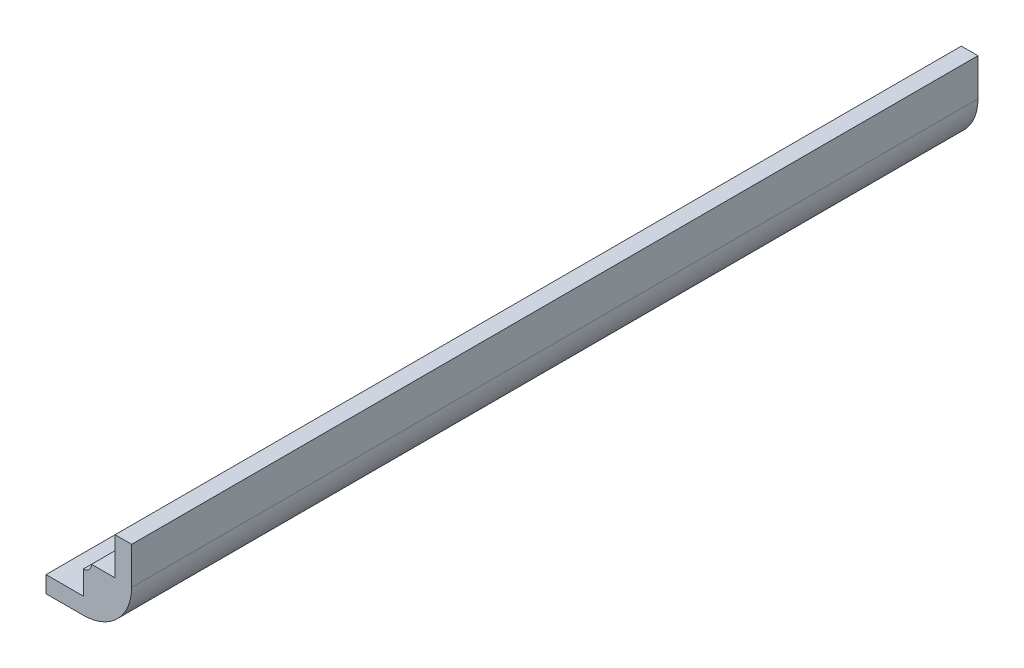
ISO-10303-21;
HEADER;
FILE_DESCRIPTION(('STEP AP214'),'2;1');
FILE_NAME('part.step','',(''),(''),'','','');
FILE_SCHEMA(('AUTOMOTIVE_DESIGN { 1 0 10303 214 1 1 1 1 }'));
ENDSEC;
DATA;
#1=APPLICATION_CONTEXT('core data for automotive mechanical design processes');
#2=APPLICATION_PROTOCOL_DEFINITION('international standard','automotive_design',2000,#1);
#3=PRODUCT_CONTEXT('',#1,'mechanical');
#4=PRODUCT('Part','Part','',(#3));
#5=PRODUCT_RELATED_PRODUCT_CATEGORY('part','',(#4));
#6=PRODUCT_DEFINITION_FORMATION('','',#4);
#7=PRODUCT_DEFINITION_CONTEXT('part definition',#1,'design');
#8=PRODUCT_DEFINITION('design','',#6,#7);
#9=PRODUCT_DEFINITION_SHAPE('','',#8);
#10=(LENGTH_UNIT() NAMED_UNIT(*) SI_UNIT(.MILLI.,.METRE.));
#11=(NAMED_UNIT(*) PLANE_ANGLE_UNIT() SI_UNIT($,.RADIAN.));
#12=(NAMED_UNIT(*) SI_UNIT($,.STERADIAN.) SOLID_ANGLE_UNIT());
#13=UNCERTAINTY_MEASURE_WITH_UNIT(LENGTH_MEASURE(1.E-05),#10,'distance_accuracy_value','');
#14=(GEOMETRIC_REPRESENTATION_CONTEXT(3) GLOBAL_UNCERTAINTY_ASSIGNED_CONTEXT((#13)) GLOBAL_UNIT_ASSIGNED_CONTEXT((#10,
#11,#12)) REPRESENTATION_CONTEXT('',''));
#15=CARTESIAN_POINT('',(0.,0.,0.));
#16=DIRECTION('',(0.,0.,1.));
#17=DIRECTION('',(1.,0.,0.));
#18=AXIS2_PLACEMENT_3D('',#15,#16,#17);
#19=CARTESIAN_POINT('',(-7.3025,-1.500000048,53.975));
#20=DIRECTION('',(1.,0.,0.));
#21=DIRECTION('',(0.,0.,-1.));
#22=AXIS2_PLACEMENT_3D('',#19,#20,#21);
#23=PLANE('',#22);
#24=DIRECTION('',(0.,-1.,0.));
#25=VECTOR('',#24,1.);
#26=CARTESIAN_POINT('',(-7.3025,-1.500000048,-53.975));
#27=LINE('',#26,#25);
#28=CARTESIAN_POINT('',(-7.3025,-1.500000048,-53.975));
#29=VERTEX_POINT('',#28);
#30=CARTESIAN_POINT('',(-7.3025,-3.621225168,-53.975));
#31=VERTEX_POINT('',#30);
#32=EDGE_CURVE('E91',#29,#31,#27,.T.);
#33=ORIENTED_EDGE('',*,*,#32,.T.);
#34=DIRECTION('',(0.,0.,-1.));
#35=VECTOR('',#34,1.);
#36=CARTESIAN_POINT('',(-7.3025,-3.621225168,53.975));
#37=LINE('',#36,#35);
#38=CARTESIAN_POINT('',(-7.3025,-3.621225168,53.975));
#39=VERTEX_POINT('',#38);
#40=EDGE_CURVE('E11',#39,#31,#37,.T.);
#41=ORIENTED_EDGE('',*,*,#40,.F.);
#42=DIRECTION('',(0.,-1.,0.));
#43=VECTOR('',#42,1.);
#44=CARTESIAN_POINT('',(-7.3025,-1.500000048,53.975));
#45=LINE('',#44,#43);
#46=CARTESIAN_POINT('',(-7.3025,-1.500000048,53.975));
#47=VERTEX_POINT('',#46);
#48=EDGE_CURVE('E85',#47,#39,#45,.T.);
#49=ORIENTED_EDGE('',*,*,#48,.F.);
#50=DIRECTION('',(0.,0.,-1.));
#51=VECTOR('',#50,1.);
#52=CARTESIAN_POINT('',(-7.3025,-1.500000048,53.975));
#53=LINE('',#52,#51);
#54=EDGE_CURVE('E79',#47,#29,#53,.T.);
#55=ORIENTED_EDGE('',*,*,#54,.T.);
#56=EDGE_LOOP('',(#33,#41,#49,#55));
#57=FACE_BOUND('',#56,.T.);
#58=ADVANCED_FACE('F39',(#57),#23,.F.);
#59=CARTESIAN_POINT('',(-7.3025,-3.621225168,53.975));
#60=DIRECTION('',(0.,1.,0.));
#61=DIRECTION('',(0.,0.,1.));
#62=AXIS2_PLACEMENT_3D('',#59,#60,#61);
#63=PLANE('',#62);
#64=DIRECTION('',(1.,0.,0.));
#65=VECTOR('',#64,1.);
#66=CARTESIAN_POINT('',(-7.3025,-3.621225168,-53.975));
#67=LINE('',#66,#65);
#68=CARTESIAN_POINT('',(-2.54,-3.62122516799999,-53.975));
#69=VERTEX_POINT('',#68);
#70=EDGE_CURVE('E86',#31,#69,#67,.T.);
#71=ORIENTED_EDGE('',*,*,#70,.T.);
#72=DIRECTION('',(0.,0.,-1.));
#73=VECTOR('',#72,1.);
#74=CARTESIAN_POINT('',(-2.54,-3.621225168,53.975));
#75=LINE('',#74,#73);
#76=CARTESIAN_POINT('',(-2.54,-3.62122516799999,53.975));
#77=VERTEX_POINT('',#76);
#78=EDGE_CURVE('E48',#77,#69,#75,.T.);
#79=ORIENTED_EDGE('',*,*,#78,.F.);
#80=DIRECTION('',(1.,0.,0.));
#81=VECTOR('',#80,1.);
#82=CARTESIAN_POINT('',(-7.3025,-3.621225168,53.975));
#83=LINE('',#82,#81);
#84=EDGE_CURVE('E135',#39,#77,#83,.T.);
#85=ORIENTED_EDGE('',*,*,#84,.F.);
#86=ORIENTED_EDGE('',*,*,#40,.T.);
#87=EDGE_LOOP('',(#71,#79,#85,#86));
#88=FACE_BOUND('',#87,.T.);
#89=ADVANCED_FACE('F134',(#88),#63,.F.);
#90=CARTESIAN_POINT('',(-7.3025,-1.500000048,53.975));
#91=DIRECTION('',(0.,-1.,0.));
#92=DIRECTION('',(1.,0.,0.));
#93=AXIS2_PLACEMENT_3D('',#90,#91,#92);
#94=PLANE('',#93);
#95=DIRECTION('',(-1.,0.,0.));
#96=VECTOR('',#95,1.);
#97=CARTESIAN_POINT('',(-7.3025,-1.500000048,-53.975));
#98=LINE('',#97,#96);
#99=CARTESIAN_POINT('',(-2.54,-1.500000048,-53.975));
#100=VERTEX_POINT('',#99);
#101=EDGE_CURVE('E76',#100,#29,#98,.T.);
#102=ORIENTED_EDGE('',*,*,#101,.T.);
#103=ORIENTED_EDGE('',*,*,#54,.F.);
#104=DIRECTION('',(-1.,0.,0.));
#105=VECTOR('',#104,1.);
#106=CARTESIAN_POINT('',(-7.3025,-1.500000048,53.975));
#107=LINE('',#106,#105);
#108=CARTESIAN_POINT('',(-2.54,-1.500000048,53.975));
#109=VERTEX_POINT('',#108);
#110=EDGE_CURVE('E56',#109,#47,#107,.T.);
#111=ORIENTED_EDGE('',*,*,#110,.F.);
#112=DIRECTION('',(0.,0.,-1.));
#113=VECTOR('',#112,1.);
#114=CARTESIAN_POINT('',(-2.54,-1.500000048,53.975));
#115=LINE('',#114,#113);
#116=EDGE_CURVE('E81',#109,#100,#115,.T.);
#117=ORIENTED_EDGE('',*,*,#116,.T.);
#118=EDGE_LOOP('',(#102,#103,#111,#117));
#119=FACE_BOUND('',#118,.T.);
#120=ADVANCED_FACE('F78',(#119),#94,.F.);
#121=CARTESIAN_POINT('',(0.,0.,53.975));
#122=DIRECTION('',(0.,0.,1.));
#123=DIRECTION('',(1.,0.,0.));
#124=AXIS2_PLACEMENT_3D('',#121,#122,#123);
#125=PLANE('',#124);
#126=DIRECTION('',(0.,-1.,0.));
#127=VECTOR('',#126,1.);
#128=CARTESIAN_POINT('',(1.50000004799997,7.30250000000001,53.975));
#129=LINE('',#128,#127);
#130=CARTESIAN_POINT('',(1.50000004799997,7.30250000000001,53.975));
#131=VERTEX_POINT('',#130);
#132=CARTESIAN_POINT('',(1.50000004799999,2.54000000000001,53.975));
#133=VERTEX_POINT('',#132);
#134=EDGE_CURVE('E185',#131,#133,#129,.T.);
#135=ORIENTED_EDGE('',*,*,#134,.T.);
#136=DIRECTION('',(-1.,0.,0.));
#137=VECTOR('',#136,1.);
#138=CARTESIAN_POINT('',(1.50000004799999,2.54000000000001,53.975));
#139=LINE('',#138,#137);
#140=CARTESIAN_POINT('',(-1.50000004800001,2.53999999999999,53.975));
#141=VERTEX_POINT('',#140);
#142=EDGE_CURVE('E160',#133,#141,#139,.T.);
#143=ORIENTED_EDGE('',*,*,#142,.T.);
#144=CARTESIAN_POINT('',(-2.54,2.53999999999999,53.975));
#145=DIRECTION('',(0.,0.,-1.));
#146=DIRECTION('',(-1.,0.,0.));
#147=AXIS2_PLACEMENT_3D('',#144,#145,#146);
#148=CIRCLE('',#147,1.03999995199999);
#149=CARTESIAN_POINT('',(-2.54,1.500000048,53.975));
#150=VERTEX_POINT('',#149);
#151=EDGE_CURVE('E165',#141,#150,#148,.T.);
#152=ORIENTED_EDGE('',*,*,#151,.T.);
#153=DIRECTION('',(0.,-1.,0.));
#154=VECTOR('',#153,1.);
#155=CARTESIAN_POINT('',(-2.54,1.500000048,53.975));
#156=LINE('',#155,#154);
#157=EDGE_CURVE('E198',#150,#109,#156,.T.);
#158=ORIENTED_EDGE('',*,*,#157,.T.);
#159=ORIENTED_EDGE('',*,*,#110,.T.);
#160=ORIENTED_EDGE('',*,*,#48,.T.);
#161=ORIENTED_EDGE('',*,*,#84,.T.);
#162=CARTESIAN_POINT('',(-2.54,2.53999999999999,53.975));
#163=DIRECTION('',(0.,0.,1.));
#164=DIRECTION('',(-1.,0.,0.));
#165=AXIS2_PLACEMENT_3D('',#162,#163,#164);
#166=CIRCLE('',#165,6.16122516799998);
#167=CARTESIAN_POINT('',(3.62122516799997,2.54000000000002,53.975));
#168=VERTEX_POINT('',#167);
#169=EDGE_CURVE('E124',#77,#168,#166,.T.);
#170=ORIENTED_EDGE('',*,*,#169,.T.);
#171=DIRECTION('',(0.,1.,0.));
#172=VECTOR('',#171,1.);
#173=CARTESIAN_POINT('',(3.62122516799997,7.30250000000001,53.975));
#174=LINE('',#173,#172);
#175=CARTESIAN_POINT('',(3.62122516799997,7.30250000000001,53.975));
#176=VERTEX_POINT('',#175);
#177=EDGE_CURVE('E192',#168,#176,#174,.T.);
#178=ORIENTED_EDGE('',*,*,#177,.T.);
#179=DIRECTION('',(-1.,0.,0.));
#180=VECTOR('',#179,1.);
#181=CARTESIAN_POINT('',(3.62122516799997,7.30250000000001,53.975));
#182=LINE('',#181,#180);
#183=EDGE_CURVE('E188',#176,#131,#182,.T.);
#184=ORIENTED_EDGE('',*,*,#183,.T.);
#185=EDGE_LOOP('',(#135,#143,#152,#158,#159,#160,#161,#170,#178,#184));
#186=FACE_BOUND('',#185,.T.);
#187=ADVANCED_FACE('F138',(#186),#125,.T.);
#188=CARTESIAN_POINT('',(0.,0.,-53.975));
#189=DIRECTION('',(0.,0.,1.));
#190=DIRECTION('',(1.,0.,0.));
#191=AXIS2_PLACEMENT_3D('',#188,#189,#190);
#192=PLANE('',#191);
#193=DIRECTION('',(0.,1.,0.));
#194=VECTOR('',#193,1.);
#195=CARTESIAN_POINT('',(3.62122516799997,7.30250000000001,-53.975));
#196=LINE('',#195,#194);
#197=CARTESIAN_POINT('',(3.62122516799997,2.54000000000002,-53.975));
#198=VERTEX_POINT('',#197);
#199=CARTESIAN_POINT('',(3.62122516799997,7.30250000000001,-53.975));
#200=VERTEX_POINT('',#199);
#201=EDGE_CURVE('E131',#198,#200,#196,.T.);
#202=ORIENTED_EDGE('',*,*,#201,.F.);
#203=CARTESIAN_POINT('',(-2.54,2.53999999999999,-53.975));
#204=DIRECTION('',(0.,0.,1.));
#205=DIRECTION('',(-1.,0.,0.));
#206=AXIS2_PLACEMENT_3D('',#203,#204,#205);
#207=CIRCLE('',#206,6.16122516799998);
#208=EDGE_CURVE('E120',#69,#198,#207,.T.);
#209=ORIENTED_EDGE('',*,*,#208,.F.);
#210=ORIENTED_EDGE('',*,*,#70,.F.);
#211=ORIENTED_EDGE('',*,*,#32,.F.);
#212=ORIENTED_EDGE('',*,*,#101,.F.);
#213=DIRECTION('',(0.,-1.,0.));
#214=VECTOR('',#213,1.);
#215=CARTESIAN_POINT('',(-2.54,1.500000048,-53.975));
#216=LINE('',#215,#214);
#217=CARTESIAN_POINT('',(-2.54,1.500000048,-53.975));
#218=VERTEX_POINT('',#217);
#219=EDGE_CURVE('E71',#218,#100,#216,.T.);
#220=ORIENTED_EDGE('',*,*,#219,.F.);
#221=CARTESIAN_POINT('',(-2.54,2.53999999999999,-53.975));
#222=DIRECTION('',(0.,0.,-1.));
#223=DIRECTION('',(-1.,0.,0.));
#224=AXIS2_PLACEMENT_3D('',#221,#222,#223);
#225=CIRCLE('',#224,1.03999995199999);
#226=CARTESIAN_POINT('',(-1.50000004800001,2.53999999999999,-53.975));
#227=VERTEX_POINT('',#226);
#228=EDGE_CURVE('E178',#227,#218,#225,.T.);
#229=ORIENTED_EDGE('',*,*,#228,.F.);
#230=DIRECTION('',(-1.,0.,0.));
#231=VECTOR('',#230,1.);
#232=CARTESIAN_POINT('',(1.50000004799999,2.54000000000001,-53.975));
#233=LINE('',#232,#231);
#234=CARTESIAN_POINT('',(1.50000004799999,2.54000000000001,-53.975));
#235=VERTEX_POINT('',#234);
#236=EDGE_CURVE('E161',#235,#227,#233,.T.);
#237=ORIENTED_EDGE('',*,*,#236,.F.);
#238=DIRECTION('',(0.,-1.,0.));
#239=VECTOR('',#238,1.);
#240=CARTESIAN_POINT('',(1.50000004799997,7.30250000000001,-53.975));
#241=LINE('',#240,#239);
#242=CARTESIAN_POINT('',(1.50000004799997,7.30250000000001,-53.975));
#243=VERTEX_POINT('',#242);
#244=EDGE_CURVE('E166',#243,#235,#241,.T.);
#245=ORIENTED_EDGE('',*,*,#244,.F.);
#246=DIRECTION('',(-1.,0.,0.));
#247=VECTOR('',#246,1.);
#248=CARTESIAN_POINT('',(3.62122516799997,7.30250000000001,-53.975));
#249=LINE('',#248,#247);
#250=EDGE_CURVE('E170',#200,#243,#249,.T.);
#251=ORIENTED_EDGE('',*,*,#250,.F.);
#252=EDGE_LOOP('',(#202,#209,#210,#211,#212,#220,#229,#237,#245,#251));
#253=FACE_BOUND('',#252,.T.);
#254=ADVANCED_FACE('F95',(#253),#192,.F.);
#255=CARTESIAN_POINT('',(-2.54,2.53999999999999,53.975));
#256=DIRECTION('',(0.,0.,-1.));
#257=DIRECTION('',(-1.,0.,0.));
#258=AXIS2_PLACEMENT_3D('',#255,#256,#257);
#259=CYLINDRICAL_SURFACE('',#258,1.03999995199999);
#260=ORIENTED_EDGE('',*,*,#228,.T.);
#261=DIRECTION('',(0.,0.,-1.));
#262=VECTOR('',#261,1.);
#263=CARTESIAN_POINT('',(-2.54,1.500000048,53.975));
#264=LINE('',#263,#262);
#265=EDGE_CURVE('E99',#150,#218,#264,.T.);
#266=ORIENTED_EDGE('',*,*,#265,.F.);
#267=ORIENTED_EDGE('',*,*,#151,.F.);
#268=DIRECTION('',(0.,0.,-1.));
#269=VECTOR('',#268,1.);
#270=CARTESIAN_POINT('',(-1.50000004800001,2.53999999999999,53.975));
#271=LINE('',#270,#269);
#272=EDGE_CURVE('E156',#141,#227,#271,.T.);
#273=ORIENTED_EDGE('',*,*,#272,.T.);
#274=EDGE_LOOP('',(#260,#266,#267,#273));
#275=FACE_BOUND('',#274,.T.);
#276=ADVANCED_FACE('F213',(#275),#259,.F.);
#277=CARTESIAN_POINT('',(-2.54,1.500000048,53.975));
#278=DIRECTION('',(1.,0.,0.));
#279=DIRECTION('',(0.,0.,-1.));
#280=AXIS2_PLACEMENT_3D('',#277,#278,#279);
#281=PLANE('',#280);
#282=ORIENTED_EDGE('',*,*,#219,.T.);
#283=ORIENTED_EDGE('',*,*,#116,.F.);
#284=ORIENTED_EDGE('',*,*,#157,.F.);
#285=ORIENTED_EDGE('',*,*,#265,.T.);
#286=EDGE_LOOP('',(#282,#283,#284,#285));
#287=FACE_BOUND('',#286,.T.);
#288=ADVANCED_FACE('F215',(#287),#281,.F.);
#289=CARTESIAN_POINT('',(-2.54,2.53999999999999,53.975));
#290=DIRECTION('',(0.,0.,-1.));
#291=DIRECTION('',(-1.,0.,0.));
#292=AXIS2_PLACEMENT_3D('',#289,#290,#291);
#293=CYLINDRICAL_SURFACE('',#292,6.16122516799998);
#294=ORIENTED_EDGE('',*,*,#208,.T.);
#295=DIRECTION('',(0.,0.,-1.));
#296=VECTOR('',#295,1.);
#297=CARTESIAN_POINT('',(3.62122516799997,2.54000000000002,53.975));
#298=LINE('',#297,#296);
#299=EDGE_CURVE('E104',#168,#198,#298,.T.);
#300=ORIENTED_EDGE('',*,*,#299,.F.);
#301=ORIENTED_EDGE('',*,*,#169,.F.);
#302=ORIENTED_EDGE('',*,*,#78,.T.);
#303=EDGE_LOOP('',(#294,#300,#301,#302));
#304=FACE_BOUND('',#303,.T.);
#305=ADVANCED_FACE('F117',(#304),#293,.T.);
#306=CARTESIAN_POINT('',(3.62122516799997,7.30250000000001,53.975));
#307=DIRECTION('',(-1.,0.,0.));
#308=DIRECTION('',(0.,0.,1.));
#309=AXIS2_PLACEMENT_3D('',#306,#307,#308);
#310=PLANE('',#309);
#311=ORIENTED_EDGE('',*,*,#201,.T.);
#312=DIRECTION('',(0.,0.,-1.));
#313=VECTOR('',#312,1.);
#314=CARTESIAN_POINT('',(3.62122516799997,7.30250000000001,53.975));
#315=LINE('',#314,#313);
#316=EDGE_CURVE('E144',#176,#200,#315,.T.);
#317=ORIENTED_EDGE('',*,*,#316,.F.);
#318=ORIENTED_EDGE('',*,*,#177,.F.);
#319=ORIENTED_EDGE('',*,*,#299,.T.);
#320=EDGE_LOOP('',(#311,#317,#318,#319));
#321=FACE_BOUND('',#320,.T.);
#322=ADVANCED_FACE('F250',(#321),#310,.F.);
#323=CARTESIAN_POINT('',(3.62122516799997,7.30250000000001,53.975));
#324=DIRECTION('',(0.,-1.,0.));
#325=DIRECTION('',(1.,0.,0.));
#326=AXIS2_PLACEMENT_3D('',#323,#324,#325);
#327=PLANE('',#326);
#328=ORIENTED_EDGE('',*,*,#250,.T.);
#329=DIRECTION('',(0.,0.,-1.));
#330=VECTOR('',#329,1.);
#331=CARTESIAN_POINT('',(1.50000004799997,7.30250000000001,53.975));
#332=LINE('',#331,#330);
#333=EDGE_CURVE('E148',#131,#243,#332,.T.);
#334=ORIENTED_EDGE('',*,*,#333,.F.);
#335=ORIENTED_EDGE('',*,*,#183,.F.);
#336=ORIENTED_EDGE('',*,*,#316,.T.);
#337=EDGE_LOOP('',(#328,#334,#335,#336));
#338=FACE_BOUND('',#337,.T.);
#339=ADVANCED_FACE('F239',(#338),#327,.F.);
#340=CARTESIAN_POINT('',(1.50000004799997,7.30250000000001,53.975));
#341=DIRECTION('',(1.,0.,0.));
#342=DIRECTION('',(0.,1.,0.));
#343=AXIS2_PLACEMENT_3D('',#340,#341,#342);
#344=PLANE('',#343);
#345=ORIENTED_EDGE('',*,*,#244,.T.);
#346=DIRECTION('',(0.,0.,-1.));
#347=VECTOR('',#346,1.);
#348=CARTESIAN_POINT('',(1.50000004799999,2.54000000000001,53.975));
#349=LINE('',#348,#347);
#350=EDGE_CURVE('E152',#133,#235,#349,.T.);
#351=ORIENTED_EDGE('',*,*,#350,.F.);
#352=ORIENTED_EDGE('',*,*,#134,.F.);
#353=ORIENTED_EDGE('',*,*,#333,.T.);
#354=EDGE_LOOP('',(#345,#351,#352,#353));
#355=FACE_BOUND('',#354,.T.);
#356=ADVANCED_FACE('F232',(#355),#344,.F.);
#357=CARTESIAN_POINT('',(1.50000004799999,2.54000000000001,53.975));
#358=DIRECTION('',(0.,-1.,0.));
#359=DIRECTION('',(1.,0.,0.));
#360=AXIS2_PLACEMENT_3D('',#357,#358,#359);
#361=PLANE('',#360);
#362=ORIENTED_EDGE('',*,*,#236,.T.);
#363=ORIENTED_EDGE('',*,*,#272,.F.);
#364=ORIENTED_EDGE('',*,*,#142,.F.);
#365=ORIENTED_EDGE('',*,*,#350,.T.);
#366=EDGE_LOOP('',(#362,#363,#364,#365));
#367=FACE_BOUND('',#366,.T.);
#368=ADVANCED_FACE('F228',(#367),#361,.F.);
#369=CLOSED_SHELL('',(#58,#89,#120,#187,#254,#276,#288,#305,#322,#339,#356,#368));
#370=MANIFOLD_SOLID_BREP('B2',#369);
#371=ADVANCED_BREP_SHAPE_REPRESENTATION('',(#18,#370),#14);
#372=SHAPE_DEFINITION_REPRESENTATION(#9,#371);
ENDSEC;
END-ISO-10303-21;
